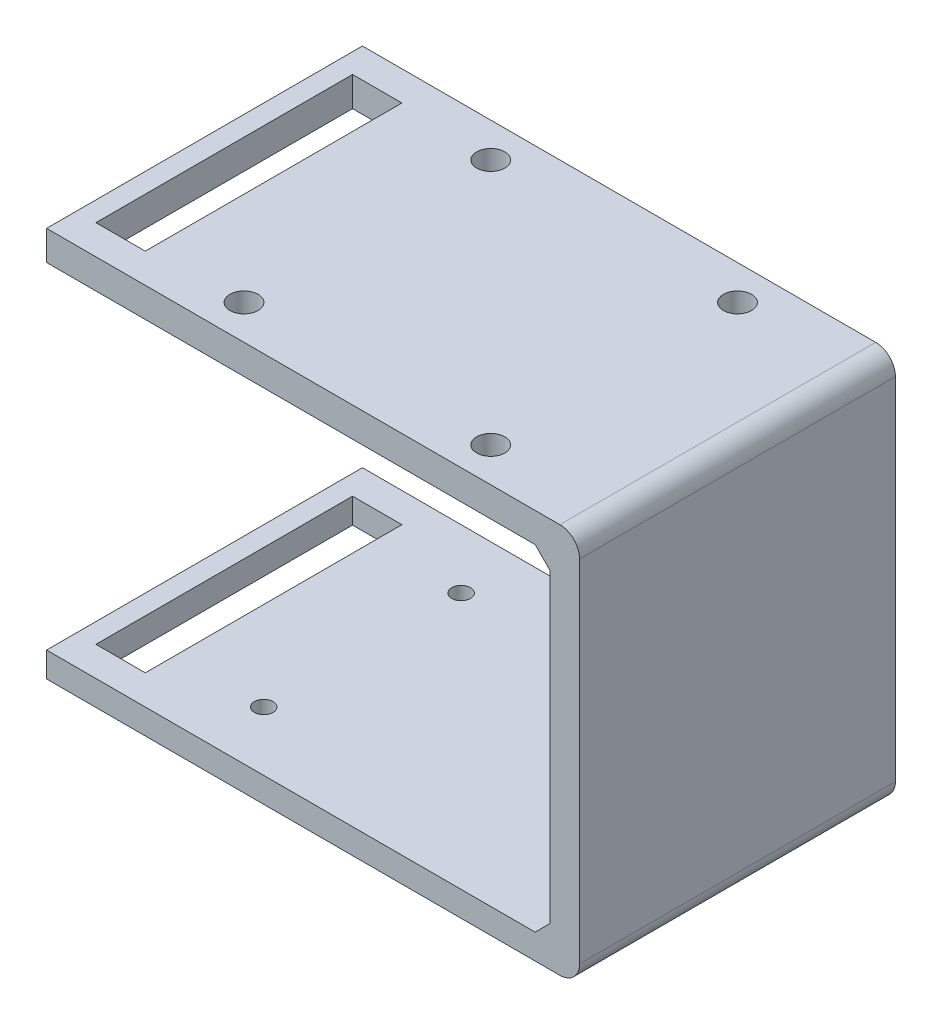
ISO-10303-21;
HEADER;
FILE_DESCRIPTION(('STEP AP214'),'2;1');
FILE_NAME('part.step','',(''),(''),'','','');
FILE_SCHEMA(('AUTOMOTIVE_DESIGN { 1 0 10303 214 1 1 1 1 }'));
ENDSEC;
DATA;
#1=APPLICATION_CONTEXT('core data for automotive mechanical design processes');
#2=APPLICATION_PROTOCOL_DEFINITION('international standard','automotive_design',2000,#1);
#3=PRODUCT_CONTEXT('',#1,'mechanical');
#4=PRODUCT('Part','Part','',(#3));
#5=PRODUCT_RELATED_PRODUCT_CATEGORY('part','',(#4));
#6=PRODUCT_DEFINITION_FORMATION('','',#4);
#7=PRODUCT_DEFINITION_CONTEXT('part definition',#1,'design');
#8=PRODUCT_DEFINITION('design','',#6,#7);
#9=PRODUCT_DEFINITION_SHAPE('','',#8);
#10=(LENGTH_UNIT() NAMED_UNIT(*) SI_UNIT(.MILLI.,.METRE.));
#11=(NAMED_UNIT(*) PLANE_ANGLE_UNIT() SI_UNIT($,.RADIAN.));
#12=(NAMED_UNIT(*) SI_UNIT($,.STERADIAN.) SOLID_ANGLE_UNIT());
#13=UNCERTAINTY_MEASURE_WITH_UNIT(LENGTH_MEASURE(1.E-05),#10,'distance_accuracy_value','');
#14=(GEOMETRIC_REPRESENTATION_CONTEXT(3) GLOBAL_UNCERTAINTY_ASSIGNED_CONTEXT((#13)) GLOBAL_UNIT_ASSIGNED_CONTEXT((#10,
#11,#12)) REPRESENTATION_CONTEXT('',''));
#15=CARTESIAN_POINT('',(0.,0.,0.));
#16=DIRECTION('',(0.,0.,1.));
#17=DIRECTION('',(1.,0.,0.));
#18=AXIS2_PLACEMENT_3D('',#15,#16,#17);
#19=CARTESIAN_POINT('',(0.,39.54,0.));
#20=DIRECTION('',(0.,1.,0.));
#21=DIRECTION('',(0.,0.,1.));
#22=AXIS2_PLACEMENT_3D('',#19,#20,#21);
#23=PLANE('',#22);
#24=DIRECTION('',(0.,0.,1.));
#25=VECTOR('',#24,1.);
#26=CARTESIAN_POINT('',(-24.,39.54,0.));
#27=LINE('',#26,#25);
#28=CARTESIAN_POINT('',(-24.,39.54,-3.));
#29=VERTEX_POINT('',#28);
#30=CARTESIAN_POINT('',(-24.,39.54,23.));
#31=VERTEX_POINT('',#30);
#32=EDGE_CURVE('E272',#29,#31,#27,.T.);
#33=ORIENTED_EDGE('',*,*,#32,.F.);
#34=DIRECTION('',(-1.,0.,0.));
#35=VECTOR('',#34,1.);
#36=CARTESIAN_POINT('',(0.,39.54,-3.));
#37=LINE('',#36,#35);
#38=CARTESIAN_POINT('',(-19.,39.54,-3.));
#39=VERTEX_POINT('',#38);
#40=EDGE_CURVE('E263',#39,#29,#37,.T.);
#41=ORIENTED_EDGE('',*,*,#40,.F.);
#42=DIRECTION('',(0.,0.,-1.));
#43=VECTOR('',#42,1.);
#44=CARTESIAN_POINT('',(-19.,39.54,0.));
#45=LINE('',#44,#43);
#46=CARTESIAN_POINT('',(-19.,39.54,23.));
#47=VERTEX_POINT('',#46);
#48=EDGE_CURVE('E253',#47,#39,#45,.T.);
#49=ORIENTED_EDGE('',*,*,#48,.F.);
#50=DIRECTION('',(1.,0.,0.));
#51=VECTOR('',#50,1.);
#52=CARTESIAN_POINT('',(0.,39.54,23.));
#53=LINE('',#52,#51);
#54=EDGE_CURVE('E243',#31,#47,#53,.T.);
#55=ORIENTED_EDGE('',*,*,#54,.F.);
#56=EDGE_LOOP('',(#33,#41,#49,#55));
#57=FACE_BOUND('',#56,.T.);
#58=CARTESIAN_POINT('',(15.5,39.54,-2.50000000000001));
#59=DIRECTION('',(0.,1.,0.));
#60=DIRECTION('',(0.,0.,1.));
#61=AXIS2_PLACEMENT_3D('',#58,#59,#60);
#62=CIRCLE('',#61,1.425);
#63=CARTESIAN_POINT('',(15.5,39.54,-1.07500000000001));
#64=VERTEX_POINT('',#63);
#65=EDGE_CURVE('E293',#64,#64,#62,.F.);
#66=ORIENTED_EDGE('',*,*,#65,.T.);
#67=EDGE_LOOP('',(#66));
#68=FACE_BOUND('',#67,.T.);
#69=CARTESIAN_POINT('',(-9.50000000000004,39.54,-2.50000000000001));
#70=DIRECTION('',(0.,1.,0.));
#71=DIRECTION('',(0.,0.,1.));
#72=AXIS2_PLACEMENT_3D('',#69,#70,#71);
#73=CIRCLE('',#72,1.425);
#74=CARTESIAN_POINT('',(-9.50000000000004,39.54,-1.07500000000001));
#75=VERTEX_POINT('',#74);
#76=EDGE_CURVE('E297',#75,#75,#73,.T.);
#77=ORIENTED_EDGE('',*,*,#76,.F.);
#78=EDGE_LOOP('',(#77));
#79=FACE_BOUND('',#78,.T.);
#80=DIRECTION('',(1.,0.,0.));
#81=VECTOR('',#80,1.);
#82=CARTESIAN_POINT('',(25.,39.54,26.));
#83=LINE('',#82,#81);
#84=CARTESIAN_POINT('',(-26.,39.54,26.));
#85=VERTEX_POINT('',#84);
#86=CARTESIAN_POINT('',(26.,39.54,26.));
#87=VERTEX_POINT('',#86);
#88=EDGE_CURVE('E318',#85,#87,#83,.T.);
#89=ORIENTED_EDGE('',*,*,#88,.T.);
#90=DIRECTION('',(0.,0.,-1.));
#91=VECTOR('',#90,1.);
#92=CARTESIAN_POINT('',(26.,39.54,0.));
#93=LINE('',#92,#91);
#94=CARTESIAN_POINT('',(26.,39.54,-6.));
#95=VERTEX_POINT('',#94);
#96=EDGE_CURVE('E414',#87,#95,#93,.T.);
#97=ORIENTED_EDGE('',*,*,#96,.T.);
#98=DIRECTION('',(-1.,0.,0.));
#99=VECTOR('',#98,1.);
#100=CARTESIAN_POINT('',(25.,39.54,-6.));
#101=LINE('',#100,#99);
#102=CARTESIAN_POINT('',(-26.,39.54,-6.));
#103=VERTEX_POINT('',#102);
#104=EDGE_CURVE('E322',#95,#103,#101,.T.);
#105=ORIENTED_EDGE('',*,*,#104,.T.);
#106=DIRECTION('',(0.,0.,-1.));
#107=VECTOR('',#106,1.);
#108=CARTESIAN_POINT('',(-26.,39.54,-6.));
#109=LINE('',#108,#107);
#110=EDGE_CURVE('E288',#85,#103,#109,.T.);
#111=ORIENTED_EDGE('',*,*,#110,.F.);
#112=EDGE_LOOP('',(#89,#97,#105,#111));
#113=FACE_BOUND('',#112,.T.);
#114=CARTESIAN_POINT('',(15.5,39.54,22.5));
#115=DIRECTION('',(0.,1.,0.));
#116=DIRECTION('',(0.,0.,1.));
#117=AXIS2_PLACEMENT_3D('',#114,#115,#116);
#118=CIRCLE('',#117,1.425);
#119=CARTESIAN_POINT('',(15.5,39.54,23.925));
#120=VERTEX_POINT('',#119);
#121=EDGE_CURVE('E298',#120,#120,#118,.T.);
#122=ORIENTED_EDGE('',*,*,#121,.F.);
#123=EDGE_LOOP('',(#122));
#124=FACE_BOUND('',#123,.T.);
#125=CARTESIAN_POINT('',(-9.50000000000004,39.54,22.5));
#126=DIRECTION('',(0.,1.,0.));
#127=DIRECTION('',(0.,0.,1.));
#128=AXIS2_PLACEMENT_3D('',#125,#126,#127);
#129=CIRCLE('',#128,1.425);
#130=CARTESIAN_POINT('',(-9.50000000000004,39.54,23.925));
#131=VERTEX_POINT('',#130);
#132=EDGE_CURVE('E292',#131,#131,#129,.F.);
#133=ORIENTED_EDGE('',*,*,#132,.T.);
#134=EDGE_LOOP('',(#133));
#135=FACE_BOUND('',#134,.T.);
#136=ADVANCED_FACE('F51',(#57,#68,#79,#113,#124,#135),#23,.T.);
#137=CARTESIAN_POINT('',(-22.,36.54,-6.));
#138=DIRECTION('',(0.,1.,0.));
#139=DIRECTION('',(0.,0.,1.));
#140=AXIS2_PLACEMENT_3D('',#137,#138,#139);
#141=PLANE('',#140);
#142=DIRECTION('',(-1.,0.,0.));
#143=VECTOR('',#142,1.);
#144=CARTESIAN_POINT('',(-22.,36.54,-3.));
#145=LINE('',#144,#143);
#146=CARTESIAN_POINT('',(-19.,36.54,-3.));
#147=VERTEX_POINT('',#146);
#148=CARTESIAN_POINT('',(-24.,36.54,-3.));
#149=VERTEX_POINT('',#148);
#150=EDGE_CURVE('E259',#147,#149,#145,.T.);
#151=ORIENTED_EDGE('',*,*,#150,.T.);
#152=DIRECTION('',(0.,0.,1.));
#153=VECTOR('',#152,1.);
#154=CARTESIAN_POINT('',(-24.,36.54,-6.));
#155=LINE('',#154,#153);
#156=CARTESIAN_POINT('',(-24.,36.54,23.));
#157=VERTEX_POINT('',#156);
#158=EDGE_CURVE('E268',#149,#157,#155,.T.);
#159=ORIENTED_EDGE('',*,*,#158,.T.);
#160=DIRECTION('',(1.,0.,0.));
#161=VECTOR('',#160,1.);
#162=CARTESIAN_POINT('',(-22.,36.54,23.));
#163=LINE('',#162,#161);
#164=CARTESIAN_POINT('',(-19.,36.54,23.));
#165=VERTEX_POINT('',#164);
#166=EDGE_CURVE('E239',#157,#165,#163,.T.);
#167=ORIENTED_EDGE('',*,*,#166,.T.);
#168=DIRECTION('',(0.,0.,-1.));
#169=VECTOR('',#168,1.);
#170=CARTESIAN_POINT('',(-19.,36.54,-6.));
#171=LINE('',#170,#169);
#172=EDGE_CURVE('E249',#165,#147,#171,.T.);
#173=ORIENTED_EDGE('',*,*,#172,.T.);
#174=EDGE_LOOP('',(#151,#159,#167,#173));
#175=FACE_BOUND('',#174,.T.);
#176=CARTESIAN_POINT('',(15.5,36.54,22.5));
#177=DIRECTION('',(0.,1.,0.));
#178=DIRECTION('',(0.,0.,1.));
#179=AXIS2_PLACEMENT_3D('',#176,#177,#178);
#180=CIRCLE('',#179,1.425);
#181=CARTESIAN_POINT('',(15.5,36.54,23.925));
#182=VERTEX_POINT('',#181);
#183=EDGE_CURVE('E426',#182,#182,#180,.T.);
#184=ORIENTED_EDGE('',*,*,#183,.T.);
#185=EDGE_LOOP('',(#184));
#186=FACE_BOUND('',#185,.T.);
#187=CARTESIAN_POINT('',(-9.50000000000004,36.54,-2.50000000000001));
#188=DIRECTION('',(0.,1.,0.));
#189=DIRECTION('',(0.,0.,1.));
#190=AXIS2_PLACEMENT_3D('',#187,#188,#189);
#191=CIRCLE('',#190,1.425);
#192=CARTESIAN_POINT('',(-9.50000000000004,36.54,-1.07500000000001));
#193=VERTEX_POINT('',#192);
#194=EDGE_CURVE('E308',#193,#193,#191,.T.);
#195=ORIENTED_EDGE('',*,*,#194,.T.);
#196=EDGE_LOOP('',(#195));
#197=FACE_BOUND('',#196,.T.);
#198=DIRECTION('',(1.,0.,0.));
#199=VECTOR('',#198,1.);
#200=CARTESIAN_POINT('',(-22.,36.54,-6.));
#201=LINE('',#200,#199);
#202=CARTESIAN_POINT('',(-26.,36.54,-6.));
#203=VERTEX_POINT('',#202);
#204=CARTESIAN_POINT('',(23.5,36.54,-6.));
#205=VERTEX_POINT('',#204);
#206=EDGE_CURVE('E313',#203,#205,#201,.T.);
#207=ORIENTED_EDGE('',*,*,#206,.T.);
#208=DIRECTION('',(0.,0.,1.));
#209=VECTOR('',#208,1.);
#210=CARTESIAN_POINT('',(23.5,36.54,26.));
#211=LINE('',#210,#209);
#212=CARTESIAN_POINT('',(23.5,36.54,26.));
#213=VERTEX_POINT('',#212);
#214=EDGE_CURVE('E418',#205,#213,#211,.T.);
#215=ORIENTED_EDGE('',*,*,#214,.T.);
#216=DIRECTION('',(1.,0.,0.));
#217=VECTOR('',#216,1.);
#218=CARTESIAN_POINT('',(-22.,36.54,26.));
#219=LINE('',#218,#217);
#220=CARTESIAN_POINT('',(-26.,36.54,26.));
#221=VERTEX_POINT('',#220);
#222=EDGE_CURVE('E309',#221,#213,#219,.T.);
#223=ORIENTED_EDGE('',*,*,#222,.F.);
#224=DIRECTION('',(0.,0.,1.));
#225=VECTOR('',#224,1.);
#226=CARTESIAN_POINT('',(-26.,36.54,-6.));
#227=LINE('',#226,#225);
#228=EDGE_CURVE('E280',#203,#221,#227,.T.);
#229=ORIENTED_EDGE('',*,*,#228,.F.);
#230=EDGE_LOOP('',(#207,#215,#223,#229));
#231=FACE_BOUND('',#230,.T.);
#232=CARTESIAN_POINT('',(15.5,36.54,-2.50000000000001));
#233=DIRECTION('',(0.,1.,0.));
#234=DIRECTION('',(0.,0.,1.));
#235=AXIS2_PLACEMENT_3D('',#232,#233,#234);
#236=CIRCLE('',#235,1.425);
#237=CARTESIAN_POINT('',(15.5,36.54,-1.07500000000001));
#238=VERTEX_POINT('',#237);
#239=EDGE_CURVE('E422',#238,#238,#236,.F.);
#240=ORIENTED_EDGE('',*,*,#239,.F.);
#241=EDGE_LOOP('',(#240));
#242=FACE_BOUND('',#241,.T.);
#243=CARTESIAN_POINT('',(-9.50000000000004,36.54,22.5));
#244=DIRECTION('',(0.,1.,0.));
#245=DIRECTION('',(0.,0.,1.));
#246=AXIS2_PLACEMENT_3D('',#243,#244,#245);
#247=CIRCLE('',#246,1.425);
#248=CARTESIAN_POINT('',(-9.50000000000004,36.54,23.925));
#249=VERTEX_POINT('',#248);
#250=EDGE_CURVE('E314',#249,#249,#247,.F.);
#251=ORIENTED_EDGE('',*,*,#250,.F.);
#252=EDGE_LOOP('',(#251));
#253=FACE_BOUND('',#252,.T.);
#254=ADVANCED_FACE('F477',(#175,#186,#197,#231,#242,#253),#141,.F.);
#255=CARTESIAN_POINT('',(25.,39.54,-6.));
#256=DIRECTION('',(1.,0.,0.));
#257=DIRECTION('',(0.,0.,-1.));
#258=AXIS2_PLACEMENT_3D('',#255,#256,#257);
#259=PLANE('',#258);
#260=DIRECTION('',(0.,-1.,0.));
#261=VECTOR('',#260,1.);
#262=CARTESIAN_POINT('',(25.,39.54,26.));
#263=LINE('',#262,#261);
#264=CARTESIAN_POINT('',(25.,35.04,26.));
#265=VERTEX_POINT('',#264);
#266=CARTESIAN_POINT('',(25.,4.04000000000002,26.));
#267=VERTEX_POINT('',#266);
#268=EDGE_CURVE('E329',#265,#267,#263,.T.);
#269=ORIENTED_EDGE('',*,*,#268,.F.);
#270=DIRECTION('',(0.,0.,-1.));
#271=VECTOR('',#270,1.);
#272=CARTESIAN_POINT('',(25.,35.04,-6.));
#273=LINE('',#272,#271);
#274=CARTESIAN_POINT('',(25.,35.04,-6.));
#275=VERTEX_POINT('',#274);
#276=EDGE_CURVE('E440',#265,#275,#273,.T.);
#277=ORIENTED_EDGE('',*,*,#276,.T.);
#278=DIRECTION('',(0.,-1.,0.));
#279=VECTOR('',#278,1.);
#280=CARTESIAN_POINT('',(25.,39.54,-6.));
#281=LINE('',#280,#279);
#282=CARTESIAN_POINT('',(25.,4.04000000000002,-6.));
#283=VERTEX_POINT('',#282);
#284=EDGE_CURVE('E325',#275,#283,#281,.T.);
#285=ORIENTED_EDGE('',*,*,#284,.T.);
#286=DIRECTION('',(0.,0.,1.));
#287=VECTOR('',#286,1.);
#288=CARTESIAN_POINT('',(25.,4.04000000000002,-6.));
#289=LINE('',#288,#287);
#290=EDGE_CURVE('E436',#283,#267,#289,.T.);
#291=ORIENTED_EDGE('',*,*,#290,.T.);
#292=EDGE_LOOP('',(#269,#277,#285,#291));
#293=FACE_BOUND('',#292,.T.);
#294=ADVANCED_FACE('F480',(#293),#259,.F.);
#295=CARTESIAN_POINT('',(0.,2.54,26.));
#296=DIRECTION('',(0.,0.,1.));
#297=DIRECTION('',(1.,0.,0.));
#298=AXIS2_PLACEMENT_3D('',#295,#296,#297);
#299=PLANE('',#298);
#300=DIRECTION('',(-1.,0.,0.));
#301=VECTOR('',#300,1.);
#302=CARTESIAN_POINT('',(0.,0.,26.));
#303=LINE('',#302,#301);
#304=CARTESIAN_POINT('',(26.,0.,26.));
#305=VERTEX_POINT('',#304);
#306=CARTESIAN_POINT('',(-26.,0.,26.));
#307=VERTEX_POINT('',#306);
#308=EDGE_CURVE('E368',#305,#307,#303,.T.);
#309=ORIENTED_EDGE('',*,*,#308,.F.);
#310=CARTESIAN_POINT('',(26.,2.,26.));
#311=DIRECTION('',(0.,0.,1.));
#312=DIRECTION('',(1.,0.,0.));
#313=AXIS2_PLACEMENT_3D('',#310,#311,#312);
#314=CIRCLE('',#313,2.);
#315=CARTESIAN_POINT('',(28.,2.,26.));
#316=VERTEX_POINT('',#315);
#317=EDGE_CURVE('E399',#305,#316,#314,.T.);
#318=ORIENTED_EDGE('',*,*,#317,.T.);
#319=DIRECTION('',(0.,-1.,0.));
#320=VECTOR('',#319,1.);
#321=CARTESIAN_POINT('',(28.,2.54,26.));
#322=LINE('',#321,#320);
#323=CARTESIAN_POINT('',(28.,37.54,26.));
#324=VERTEX_POINT('',#323);
#325=EDGE_CURVE('E388',#324,#316,#322,.T.);
#326=ORIENTED_EDGE('',*,*,#325,.F.);
#327=CARTESIAN_POINT('',(26.,37.54,26.));
#328=DIRECTION('',(0.,0.,1.));
#329=DIRECTION('',(1.,0.,0.));
#330=AXIS2_PLACEMENT_3D('',#327,#328,#329);
#331=CIRCLE('',#330,2.);
#332=EDGE_CURVE('E396',#324,#87,#331,.T.);
#333=ORIENTED_EDGE('',*,*,#332,.T.);
#334=ORIENTED_EDGE('',*,*,#88,.F.);
#335=DIRECTION('',(0.,1.,0.));
#336=VECTOR('',#335,1.);
#337=CARTESIAN_POINT('',(-26.,39.54,26.));
#338=LINE('',#337,#336);
#339=EDGE_CURVE('E284',#221,#85,#338,.T.);
#340=ORIENTED_EDGE('',*,*,#339,.F.);
#341=ORIENTED_EDGE('',*,*,#222,.T.);
#342=DIRECTION('',(-0.707106781186554,0.707106781186541,0.));
#343=VECTOR('',#342,1.);
#344=CARTESIAN_POINT('',(23.5,36.54,26.));
#345=LINE('',#344,#343);
#346=EDGE_CURVE('E445',#213,#265,#345,.F.);
#347=ORIENTED_EDGE('',*,*,#346,.T.);
#348=ORIENTED_EDGE('',*,*,#268,.T.);
#349=DIRECTION('',(-0.707106781186543,-0.707106781186553,0.));
#350=VECTOR('',#349,1.);
#351=CARTESIAN_POINT('',(25.,4.04000000000002,26.));
#352=LINE('',#351,#350);
#353=CARTESIAN_POINT('',(23.5,2.54,26.));
#354=VERTEX_POINT('',#353);
#355=EDGE_CURVE('E61',#267,#354,#352,.T.);
#356=ORIENTED_EDGE('',*,*,#355,.T.);
#357=DIRECTION('',(-1.,0.,0.));
#358=VECTOR('',#357,1.);
#359=CARTESIAN_POINT('',(0.,2.54,26.));
#360=LINE('',#359,#358);
#361=CARTESIAN_POINT('',(-26.,2.54,26.));
#362=VERTEX_POINT('',#361);
#363=EDGE_CURVE('E346',#354,#362,#360,.T.);
#364=ORIENTED_EDGE('',*,*,#363,.T.);
#365=DIRECTION('',(0.,-1.,0.));
#366=VECTOR('',#365,1.);
#367=CARTESIAN_POINT('',(-26.,2.54,26.));
#368=LINE('',#367,#366);
#369=EDGE_CURVE('E356',#362,#307,#368,.T.);
#370=ORIENTED_EDGE('',*,*,#369,.T.);
#371=EDGE_LOOP('',(#309,#318,#326,#333,#334,#340,#341,#347,#348,#356,#364,#370));
#372=FACE_BOUND('',#371,.T.);
#373=ADVANCED_FACE('F518',(#372),#299,.T.);
#374=CARTESIAN_POINT('',(28.,2.54,0.));
#375=DIRECTION('',(1.,0.,0.));
#376=DIRECTION('',(0.,0.,-1.));
#377=AXIS2_PLACEMENT_3D('',#374,#375,#376);
#378=PLANE('',#377);
#379=ORIENTED_EDGE('',*,*,#325,.T.);
#380=DIRECTION('',(0.,0.,1.));
#381=VECTOR('',#380,1.);
#382=CARTESIAN_POINT('',(28.,2.,-6.));
#383=LINE('',#382,#381);
#384=CARTESIAN_POINT('',(28.,2.,-6.));
#385=VERTEX_POINT('',#384);
#386=EDGE_CURVE('E405',#316,#385,#383,.F.);
#387=ORIENTED_EDGE('',*,*,#386,.T.);
#388=DIRECTION('',(0.,-1.,0.));
#389=VECTOR('',#388,1.);
#390=CARTESIAN_POINT('',(28.,2.54,-6.));
#391=LINE('',#390,#389);
#392=CARTESIAN_POINT('',(28.,37.54,-6.));
#393=VERTEX_POINT('',#392);
#394=EDGE_CURVE('E384',#393,#385,#391,.T.);
#395=ORIENTED_EDGE('',*,*,#394,.F.);
#396=DIRECTION('',(0.,0.,-1.));
#397=VECTOR('',#396,1.);
#398=CARTESIAN_POINT('',(28.,37.54,0.));
#399=LINE('',#398,#397);
#400=EDGE_CURVE('E402',#393,#324,#399,.F.);
#401=ORIENTED_EDGE('',*,*,#400,.T.);
#402=EDGE_LOOP('',(#379,#387,#395,#401));
#403=FACE_BOUND('',#402,.T.);
#404=ADVANCED_FACE('F535',(#403),#378,.T.);
#405=CARTESIAN_POINT('',(0.,2.54,-5.99999999999998));
#406=DIRECTION('',(0.,0.,1.));
#407=DIRECTION('',(1.,0.,0.));
#408=AXIS2_PLACEMENT_3D('',#405,#406,#407);
#409=PLANE('',#408);
#410=ORIENTED_EDGE('',*,*,#394,.T.);
#411=CARTESIAN_POINT('',(26.,2.,-5.99999999999999));
#412=DIRECTION('',(0.,0.,1.));
#413=DIRECTION('',(1.,0.,0.));
#414=AXIS2_PLACEMENT_3D('',#411,#412,#413);
#415=CIRCLE('',#414,2.);
#416=CARTESIAN_POINT('',(26.,0.,-5.99999999999999));
#417=VERTEX_POINT('',#416);
#418=EDGE_CURVE('E411',#385,#417,#415,.F.);
#419=ORIENTED_EDGE('',*,*,#418,.T.);
#420=DIRECTION('',(-1.,0.,0.));
#421=VECTOR('',#420,1.);
#422=CARTESIAN_POINT('',(0.,0.,-5.99999999999998));
#423=LINE('',#422,#421);
#424=CARTESIAN_POINT('',(-26.,0.,-5.99999999999998));
#425=VERTEX_POINT('',#424);
#426=EDGE_CURVE('E371',#417,#425,#423,.T.);
#427=ORIENTED_EDGE('',*,*,#426,.T.);
#428=DIRECTION('',(0.,-1.,0.));
#429=VECTOR('',#428,1.);
#430=CARTESIAN_POINT('',(-26.,2.54,-5.99999999999998));
#431=LINE('',#430,#429);
#432=CARTESIAN_POINT('',(-26.,2.54,-5.99999999999998));
#433=VERTEX_POINT('',#432);
#434=EDGE_CURVE('E380',#433,#425,#431,.T.);
#435=ORIENTED_EDGE('',*,*,#434,.F.);
#436=DIRECTION('',(-1.,0.,0.));
#437=VECTOR('',#436,1.);
#438=CARTESIAN_POINT('',(0.,2.54,-5.99999999999998));
#439=LINE('',#438,#437);
#440=CARTESIAN_POINT('',(23.5,2.54,-5.99999999999999));
#441=VERTEX_POINT('',#440);
#442=EDGE_CURVE('E349',#441,#433,#439,.T.);
#443=ORIENTED_EDGE('',*,*,#442,.F.);
#444=DIRECTION('',(0.707106781186543,0.707106781186553,0.));
#445=VECTOR('',#444,1.);
#446=CARTESIAN_POINT('',(11.7500000000002,-9.20999999999998,-5.99999999999999));
#447=LINE('',#446,#445);
#448=EDGE_CURVE('E11',#441,#283,#447,.T.);
#449=ORIENTED_EDGE('',*,*,#448,.T.);
#450=ORIENTED_EDGE('',*,*,#284,.F.);
#451=DIRECTION('',(0.707106781186554,-0.707106781186541,0.));
#452=VECTOR('',#451,1.);
#453=CARTESIAN_POINT('',(28.7499999999998,31.2900000000003,-5.99999999999999));
#454=LINE('',#453,#452);
#455=EDGE_CURVE('E448',#275,#205,#454,.F.);
#456=ORIENTED_EDGE('',*,*,#455,.T.);
#457=ORIENTED_EDGE('',*,*,#206,.F.);
#458=DIRECTION('',(0.,-1.,0.));
#459=VECTOR('',#458,1.);
#460=CARTESIAN_POINT('',(-26.,39.54,-6.));
#461=LINE('',#460,#459);
#462=EDGE_CURVE('E276',#103,#203,#461,.T.);
#463=ORIENTED_EDGE('',*,*,#462,.F.);
#464=ORIENTED_EDGE('',*,*,#104,.F.);
#465=CARTESIAN_POINT('',(26.,37.54,-5.99999999999999));
#466=DIRECTION('',(0.,0.,1.));
#467=DIRECTION('',(1.,0.,0.));
#468=AXIS2_PLACEMENT_3D('',#465,#466,#467);
#469=CIRCLE('',#468,2.);
#470=EDGE_CURVE('E408',#95,#393,#469,.F.);
#471=ORIENTED_EDGE('',*,*,#470,.T.);
#472=EDGE_LOOP('',(#410,#419,#427,#435,#443,#449,#450,#456,#457,#463,#464,#471));
#473=FACE_BOUND('',#472,.T.);
#474=ADVANCED_FACE('F531',(#473),#409,.F.);
#475=CARTESIAN_POINT('',(20.,2.54,9.99999999999999));
#476=DIRECTION('',(0.,-1.,0.));
#477=DIRECTION('',(0.,0.,-1.));
#478=AXIS2_PLACEMENT_3D('',#475,#476,#477);
#479=CYLINDRICAL_SURFACE('',#478,0.950000000000001);
#480=CARTESIAN_POINT('',(20.,2.54,9.99999999999999));
#481=DIRECTION('',(0.,1.,0.));
#482=DIRECTION('',(0.,0.,1.));
#483=AXIS2_PLACEMENT_3D('',#480,#481,#482);
#484=CIRCLE('',#483,0.950000000000001);
#485=CARTESIAN_POINT('',(20.,2.54,10.95));
#486=VERTEX_POINT('',#485);
#487=EDGE_CURVE('E342',#486,#486,#484,.T.);
#488=ORIENTED_EDGE('',*,*,#487,.T.);
#489=EDGE_LOOP('',(#488));
#490=FACE_BOUND('',#489,.T.);
#491=CARTESIAN_POINT('',(20.,0.,9.99999999999999));
#492=DIRECTION('',(0.,1.,0.));
#493=DIRECTION('',(0.,0.,1.));
#494=AXIS2_PLACEMENT_3D('',#491,#492,#493);
#495=CIRCLE('',#494,0.950000000000001);
#496=CARTESIAN_POINT('',(20.,0.,10.95));
#497=VERTEX_POINT('',#496);
#498=EDGE_CURVE('E364',#497,#497,#495,.T.);
#499=ORIENTED_EDGE('',*,*,#498,.F.);
#500=EDGE_LOOP('',(#499));
#501=FACE_BOUND('',#500,.T.);
#502=ADVANCED_FACE('F534',(#490,#501),#479,.F.);
#503=CARTESIAN_POINT('',(-10.,2.54,0.));
#504=DIRECTION('',(0.,-1.,0.));
#505=DIRECTION('',(0.,0.,-1.));
#506=AXIS2_PLACEMENT_3D('',#503,#504,#505);
#507=CYLINDRICAL_SURFACE('',#506,0.949999999999999);
#508=CARTESIAN_POINT('',(-10.,2.54,0.));
#509=DIRECTION('',(0.,1.,0.));
#510=DIRECTION('',(0.,0.,1.));
#511=AXIS2_PLACEMENT_3D('',#508,#509,#510);
#512=CIRCLE('',#511,0.949999999999999);
#513=CARTESIAN_POINT('',(-10.,2.54,0.950000000000003));
#514=VERTEX_POINT('',#513);
#515=EDGE_CURVE('E337',#514,#514,#512,.T.);
#516=ORIENTED_EDGE('',*,*,#515,.T.);
#517=EDGE_LOOP('',(#516));
#518=FACE_BOUND('',#517,.T.);
#519=CARTESIAN_POINT('',(-10.,0.,0.));
#520=DIRECTION('',(0.,1.,0.));
#521=DIRECTION('',(0.,0.,1.));
#522=AXIS2_PLACEMENT_3D('',#519,#520,#521);
#523=CIRCLE('',#522,0.949999999999999);
#524=CARTESIAN_POINT('',(-10.,0.,0.950000000000003));
#525=VERTEX_POINT('',#524);
#526=EDGE_CURVE('E360',#525,#525,#523,.T.);
#527=ORIENTED_EDGE('',*,*,#526,.F.);
#528=EDGE_LOOP('',(#527));
#529=FACE_BOUND('',#528,.T.);
#530=ADVANCED_FACE('F544',(#518,#529),#507,.F.);
#531=CARTESIAN_POINT('',(-9.99999999999999,2.54,20.));
#532=DIRECTION('',(0.,-1.,0.));
#533=DIRECTION('',(0.,0.,-1.));
#534=AXIS2_PLACEMENT_3D('',#531,#532,#533);
#535=CYLINDRICAL_SURFACE('',#534,0.949999999999999);
#536=CARTESIAN_POINT('',(-9.99999999999999,2.54,20.));
#537=DIRECTION('',(0.,1.,0.));
#538=DIRECTION('',(0.,0.,1.));
#539=AXIS2_PLACEMENT_3D('',#536,#537,#538);
#540=CIRCLE('',#539,0.949999999999999);
#541=CARTESIAN_POINT('',(-9.99999999999999,2.54,20.95));
#542=VERTEX_POINT('',#541);
#543=EDGE_CURVE('E333',#542,#542,#540,.F.);
#544=ORIENTED_EDGE('',*,*,#543,.F.);
#545=EDGE_LOOP('',(#544));
#546=FACE_BOUND('',#545,.T.);
#547=CARTESIAN_POINT('',(-9.99999999999999,0.,20.));
#548=DIRECTION('',(0.,1.,0.));
#549=DIRECTION('',(0.,0.,1.));
#550=AXIS2_PLACEMENT_3D('',#547,#548,#549);
#551=CIRCLE('',#550,0.949999999999999);
#552=CARTESIAN_POINT('',(-9.99999999999999,0.,20.95));
#553=VERTEX_POINT('',#552);
#554=EDGE_CURVE('E332',#553,#553,#551,.F.);
#555=ORIENTED_EDGE('',*,*,#554,.T.);
#556=EDGE_LOOP('',(#555));
#557=FACE_BOUND('',#556,.T.);
#558=ADVANCED_FACE('F529',(#546,#557),#535,.F.);
#559=CARTESIAN_POINT('',(-26.,2.54,0.));
#560=DIRECTION('',(1.,0.,0.));
#561=DIRECTION('',(0.,0.,-1.));
#562=AXIS2_PLACEMENT_3D('',#559,#560,#561);
#563=PLANE('',#562);
#564=DIRECTION('',(0.,0.,1.));
#565=VECTOR('',#564,1.);
#566=CARTESIAN_POINT('',(-26.,0.,0.));
#567=LINE('',#566,#565);
#568=EDGE_CURVE('E338',#425,#307,#567,.T.);
#569=ORIENTED_EDGE('',*,*,#568,.T.);
#570=ORIENTED_EDGE('',*,*,#369,.F.);
#571=DIRECTION('',(0.,0.,1.));
#572=VECTOR('',#571,1.);
#573=CARTESIAN_POINT('',(-26.,2.54,0.));
#574=LINE('',#573,#572);
#575=EDGE_CURVE('E352',#433,#362,#574,.T.);
#576=ORIENTED_EDGE('',*,*,#575,.F.);
#577=ORIENTED_EDGE('',*,*,#434,.T.);
#578=EDGE_LOOP('',(#569,#570,#576,#577));
#579=FACE_BOUND('',#578,.T.);
#580=ADVANCED_FACE('F523',(#579),#563,.F.);
#581=CARTESIAN_POINT('',(0.,2.54,0.));
#582=DIRECTION('',(0.,1.,0.));
#583=DIRECTION('',(0.,0.,1.));
#584=AXIS2_PLACEMENT_3D('',#581,#582,#583);
#585=PLANE('',#584);
#586=DIRECTION('',(0.,0.,1.));
#587=VECTOR('',#586,1.);
#588=CARTESIAN_POINT('',(-24.,2.54,0.));
#589=LINE('',#588,#587);
#590=CARTESIAN_POINT('',(-24.,2.54,-3.));
#591=VERTEX_POINT('',#590);
#592=CARTESIAN_POINT('',(-24.,2.54,23.));
#593=VERTEX_POINT('',#592);
#594=EDGE_CURVE('E196',#591,#593,#589,.T.);
#595=ORIENTED_EDGE('',*,*,#594,.F.);
#596=DIRECTION('',(-1.,0.,0.));
#597=VECTOR('',#596,1.);
#598=CARTESIAN_POINT('',(0.,2.54,-3.));
#599=LINE('',#598,#597);
#600=CARTESIAN_POINT('',(-19.,2.54,-3.));
#601=VERTEX_POINT('',#600);
#602=EDGE_CURVE('E256',#601,#591,#599,.T.);
#603=ORIENTED_EDGE('',*,*,#602,.F.);
#604=DIRECTION('',(0.,0.,-1.));
#605=VECTOR('',#604,1.);
#606=CARTESIAN_POINT('',(-19.,2.54,0.));
#607=LINE('',#606,#605);
#608=CARTESIAN_POINT('',(-19.,2.54,23.));
#609=VERTEX_POINT('',#608);
#610=EDGE_CURVE('E246',#609,#601,#607,.T.);
#611=ORIENTED_EDGE('',*,*,#610,.F.);
#612=DIRECTION('',(1.,0.,0.));
#613=VECTOR('',#612,1.);
#614=CARTESIAN_POINT('',(0.,2.54,23.));
#615=LINE('',#614,#613);
#616=EDGE_CURVE('E228',#593,#609,#615,.T.);
#617=ORIENTED_EDGE('',*,*,#616,.F.);
#618=EDGE_LOOP('',(#595,#603,#611,#617));
#619=FACE_BOUND('',#618,.T.);
#620=ORIENTED_EDGE('',*,*,#363,.F.);
#621=DIRECTION('',(0.,0.,-1.));
#622=VECTOR('',#621,1.);
#623=CARTESIAN_POINT('',(23.5,2.54,0.));
#624=LINE('',#623,#622);
#625=EDGE_CURVE('E74',#354,#441,#624,.T.);
#626=ORIENTED_EDGE('',*,*,#625,.T.);
#627=ORIENTED_EDGE('',*,*,#442,.T.);
#628=ORIENTED_EDGE('',*,*,#575,.T.);
#629=EDGE_LOOP('',(#620,#626,#627,#628));
#630=FACE_BOUND('',#629,.T.);
#631=ORIENTED_EDGE('',*,*,#543,.T.);
#632=EDGE_LOOP('',(#631));
#633=FACE_BOUND('',#632,.T.);
#634=ORIENTED_EDGE('',*,*,#515,.F.);
#635=EDGE_LOOP('',(#634));
#636=FACE_BOUND('',#635,.T.);
#637=ORIENTED_EDGE('',*,*,#487,.F.);
#638=EDGE_LOOP('',(#637));
#639=FACE_BOUND('',#638,.T.);
#640=ADVANCED_FACE('F520',(#619,#630,#633,#636,#639),#585,.T.);
#641=CARTESIAN_POINT('',(0.,0.,0.));
#642=DIRECTION('',(0.,1.,0.));
#643=DIRECTION('',(0.,0.,1.));
#644=AXIS2_PLACEMENT_3D('',#641,#642,#643);
#645=PLANE('',#644);
#646=DIRECTION('',(-1.,0.,0.));
#647=VECTOR('',#646,1.);
#648=CARTESIAN_POINT('',(-24.,0.,-3.));
#649=LINE('',#648,#647);
#650=CARTESIAN_POINT('',(-19.,0.,-3.));
#651=VERTEX_POINT('',#650);
#652=CARTESIAN_POINT('',(-24.,0.,-3.));
#653=VERTEX_POINT('',#652);
#654=EDGE_CURVE('E217',#651,#653,#649,.T.);
#655=ORIENTED_EDGE('',*,*,#654,.T.);
#656=DIRECTION('',(0.,0.,1.));
#657=VECTOR('',#656,1.);
#658=CARTESIAN_POINT('',(-24.,0.,-3.));
#659=LINE('',#658,#657);
#660=CARTESIAN_POINT('',(-24.,0.,23.));
#661=VERTEX_POINT('',#660);
#662=EDGE_CURVE('E193',#653,#661,#659,.T.);
#663=ORIENTED_EDGE('',*,*,#662,.T.);
#664=DIRECTION('',(1.,0.,0.));
#665=VECTOR('',#664,1.);
#666=CARTESIAN_POINT('',(-24.,0.,23.));
#667=LINE('',#666,#665);
#668=CARTESIAN_POINT('',(-19.,0.,23.));
#669=VERTEX_POINT('',#668);
#670=EDGE_CURVE('E205',#661,#669,#667,.T.);
#671=ORIENTED_EDGE('',*,*,#670,.T.);
#672=DIRECTION('',(0.,0.,-1.));
#673=VECTOR('',#672,1.);
#674=CARTESIAN_POINT('',(-19.,0.,-3.));
#675=LINE('',#674,#673);
#676=EDGE_CURVE('E212',#669,#651,#675,.T.);
#677=ORIENTED_EDGE('',*,*,#676,.T.);
#678=EDGE_LOOP('',(#655,#663,#671,#677));
#679=FACE_BOUND('',#678,.T.);
#680=ORIENTED_EDGE('',*,*,#554,.F.);
#681=EDGE_LOOP('',(#680));
#682=FACE_BOUND('',#681,.T.);
#683=ORIENTED_EDGE('',*,*,#526,.T.);
#684=EDGE_LOOP('',(#683));
#685=FACE_BOUND('',#684,.T.);
#686=ORIENTED_EDGE('',*,*,#498,.T.);
#687=EDGE_LOOP('',(#686));
#688=FACE_BOUND('',#687,.T.);
#689=ORIENTED_EDGE('',*,*,#426,.F.);
#690=DIRECTION('',(0.,0.,1.));
#691=VECTOR('',#690,1.);
#692=CARTESIAN_POINT('',(26.,0.,26.));
#693=LINE('',#692,#691);
#694=EDGE_CURVE('E392',#417,#305,#693,.T.);
#695=ORIENTED_EDGE('',*,*,#694,.T.);
#696=ORIENTED_EDGE('',*,*,#308,.T.);
#697=ORIENTED_EDGE('',*,*,#568,.F.);
#698=EDGE_LOOP('',(#689,#695,#696,#697));
#699=FACE_BOUND('',#698,.T.);
#700=ADVANCED_FACE('F214',(#679,#682,#685,#688,#699),#645,.F.);
#701=CARTESIAN_POINT('',(26.,2.,0.));
#702=DIRECTION('',(0.,0.,-1.));
#703=DIRECTION('',(-1.,0.,0.));
#704=AXIS2_PLACEMENT_3D('',#701,#702,#703);
#705=CYLINDRICAL_SURFACE('',#704,2.);
#706=ORIENTED_EDGE('',*,*,#418,.F.);
#707=ORIENTED_EDGE('',*,*,#386,.F.);
#708=ORIENTED_EDGE('',*,*,#317,.F.);
#709=ORIENTED_EDGE('',*,*,#694,.F.);
#710=EDGE_LOOP('',(#706,#707,#708,#709));
#711=FACE_BOUND('',#710,.T.);
#712=ADVANCED_FACE('F526',(#711),#705,.T.);
#713=CARTESIAN_POINT('',(26.,37.54,0.));
#714=DIRECTION('',(0.,0.,-1.));
#715=DIRECTION('',(-1.,0.,0.));
#716=AXIS2_PLACEMENT_3D('',#713,#714,#715);
#717=CYLINDRICAL_SURFACE('',#716,2.);
#718=ORIENTED_EDGE('',*,*,#332,.F.);
#719=ORIENTED_EDGE('',*,*,#400,.F.);
#720=ORIENTED_EDGE('',*,*,#470,.F.);
#721=ORIENTED_EDGE('',*,*,#96,.F.);
#722=EDGE_LOOP('',(#718,#719,#720,#721));
#723=FACE_BOUND('',#722,.T.);
#724=ADVANCED_FACE('F554',(#723),#717,.T.);
#725=CARTESIAN_POINT('',(-9.50000000000004,19.54,-2.50000000000001));
#726=DIRECTION('',(0.,1.,0.));
#727=DIRECTION('',(0.,0.,1.));
#728=AXIS2_PLACEMENT_3D('',#725,#726,#727);
#729=CYLINDRICAL_SURFACE('',#728,1.425);
#730=ORIENTED_EDGE('',*,*,#76,.T.);
#731=EDGE_LOOP('',(#730));
#732=FACE_BOUND('',#731,.T.);
#733=ORIENTED_EDGE('',*,*,#194,.F.);
#734=EDGE_LOOP('',(#733));
#735=FACE_BOUND('',#734,.T.);
#736=ADVANCED_FACE('F557',(#732,#735),#729,.F.);
#737=CARTESIAN_POINT('',(15.5,19.54,-2.50000000000001));
#738=DIRECTION('',(0.,1.,0.));
#739=DIRECTION('',(0.,0.,1.));
#740=AXIS2_PLACEMENT_3D('',#737,#738,#739);
#741=CYLINDRICAL_SURFACE('',#740,1.425);
#742=ORIENTED_EDGE('',*,*,#65,.F.);
#743=EDGE_LOOP('',(#742));
#744=FACE_BOUND('',#743,.T.);
#745=ORIENTED_EDGE('',*,*,#239,.T.);
#746=EDGE_LOOP('',(#745));
#747=FACE_BOUND('',#746,.T.);
#748=ADVANCED_FACE('F505',(#744,#747),#741,.F.);
#749=CARTESIAN_POINT('',(15.5,19.54,22.5));
#750=DIRECTION('',(0.,1.,0.));
#751=DIRECTION('',(0.,0.,1.));
#752=AXIS2_PLACEMENT_3D('',#749,#750,#751);
#753=CYLINDRICAL_SURFACE('',#752,1.425);
#754=ORIENTED_EDGE('',*,*,#121,.T.);
#755=EDGE_LOOP('',(#754));
#756=FACE_BOUND('',#755,.T.);
#757=ORIENTED_EDGE('',*,*,#183,.F.);
#758=EDGE_LOOP('',(#757));
#759=FACE_BOUND('',#758,.T.);
#760=ADVANCED_FACE('F496',(#756,#759),#753,.F.);
#761=CARTESIAN_POINT('',(-9.50000000000004,19.54,22.5));
#762=DIRECTION('',(0.,1.,0.));
#763=DIRECTION('',(0.,0.,1.));
#764=AXIS2_PLACEMENT_3D('',#761,#762,#763);
#765=CYLINDRICAL_SURFACE('',#764,1.425);
#766=ORIENTED_EDGE('',*,*,#132,.F.);
#767=EDGE_LOOP('',(#766));
#768=FACE_BOUND('',#767,.T.);
#769=ORIENTED_EDGE('',*,*,#250,.T.);
#770=EDGE_LOOP('',(#769));
#771=FACE_BOUND('',#770,.T.);
#772=ADVANCED_FACE('F493',(#768,#771),#765,.F.);
#773=CARTESIAN_POINT('',(-26.,0.,0.));
#774=DIRECTION('',(-1.,0.,0.));
#775=DIRECTION('',(0.,0.,1.));
#776=AXIS2_PLACEMENT_3D('',#773,#774,#775);
#777=PLANE('',#776);
#778=ORIENTED_EDGE('',*,*,#462,.T.);
#779=ORIENTED_EDGE('',*,*,#228,.T.);
#780=ORIENTED_EDGE('',*,*,#339,.T.);
#781=ORIENTED_EDGE('',*,*,#110,.T.);
#782=EDGE_LOOP('',(#778,#779,#780,#781));
#783=FACE_BOUND('',#782,.T.);
#784=ADVANCED_FACE('F495',(#783),#777,.T.);
#785=CARTESIAN_POINT('',(-24.,0.,23.));
#786=DIRECTION('',(0.,0.,1.));
#787=DIRECTION('',(1.,0.,0.));
#788=AXIS2_PLACEMENT_3D('',#785,#786,#787);
#789=PLANE('',#788);
#790=ORIENTED_EDGE('',*,*,#616,.T.);
#791=DIRECTION('',(0.,1.,0.));
#792=VECTOR('',#791,1.);
#793=CARTESIAN_POINT('',(-19.,0.,23.));
#794=LINE('',#793,#792);
#795=EDGE_CURVE('E208',#669,#609,#794,.T.);
#796=ORIENTED_EDGE('',*,*,#795,.F.);
#797=ORIENTED_EDGE('',*,*,#670,.F.);
#798=DIRECTION('',(0.,1.,0.));
#799=VECTOR('',#798,1.);
#800=CARTESIAN_POINT('',(-24.,0.,23.));
#801=LINE('',#800,#799);
#802=EDGE_CURVE('E188',#661,#593,#801,.T.);
#803=ORIENTED_EDGE('',*,*,#802,.T.);
#804=EDGE_LOOP('',(#790,#796,#797,#803));
#805=FACE_BOUND('',#804,.T.);
#806=ADVANCED_FACE('F206',(#805),#789,.F.);
#807=CARTESIAN_POINT('',(-19.,0.,-3.));
#808=DIRECTION('',(1.,0.,0.));
#809=DIRECTION('',(0.,0.,-1.));
#810=AXIS2_PLACEMENT_3D('',#807,#808,#809);
#811=PLANE('',#810);
#812=ORIENTED_EDGE('',*,*,#610,.T.);
#813=DIRECTION('',(0.,1.,0.));
#814=VECTOR('',#813,1.);
#815=CARTESIAN_POINT('',(-19.,0.,-3.));
#816=LINE('',#815,#814);
#817=EDGE_CURVE('E230',#651,#601,#816,.T.);
#818=ORIENTED_EDGE('',*,*,#817,.F.);
#819=ORIENTED_EDGE('',*,*,#676,.F.);
#820=ORIENTED_EDGE('',*,*,#795,.T.);
#821=EDGE_LOOP('',(#812,#818,#819,#820));
#822=FACE_BOUND('',#821,.T.);
#823=ADVANCED_FACE('F619',(#822),#811,.F.);
#824=CARTESIAN_POINT('',(-24.,0.,-3.));
#825=DIRECTION('',(0.,0.,-1.));
#826=DIRECTION('',(-1.,0.,0.));
#827=AXIS2_PLACEMENT_3D('',#824,#825,#826);
#828=PLANE('',#827);
#829=ORIENTED_EDGE('',*,*,#602,.T.);
#830=DIRECTION('',(0.,1.,0.));
#831=VECTOR('',#830,1.);
#832=CARTESIAN_POINT('',(-24.,0.,-3.));
#833=LINE('',#832,#831);
#834=EDGE_CURVE('E225',#653,#591,#833,.T.);
#835=ORIENTED_EDGE('',*,*,#834,.F.);
#836=ORIENTED_EDGE('',*,*,#654,.F.);
#837=ORIENTED_EDGE('',*,*,#817,.T.);
#838=EDGE_LOOP('',(#829,#835,#836,#837));
#839=FACE_BOUND('',#838,.T.);
#840=ADVANCED_FACE('F625',(#839),#828,.F.);
#841=CARTESIAN_POINT('',(-24.,0.,-3.));
#842=DIRECTION('',(-1.,0.,0.));
#843=DIRECTION('',(0.,0.,1.));
#844=AXIS2_PLACEMENT_3D('',#841,#842,#843);
#845=PLANE('',#844);
#846=ORIENTED_EDGE('',*,*,#594,.T.);
#847=ORIENTED_EDGE('',*,*,#802,.F.);
#848=ORIENTED_EDGE('',*,*,#662,.F.);
#849=ORIENTED_EDGE('',*,*,#834,.T.);
#850=EDGE_LOOP('',(#846,#847,#848,#849));
#851=FACE_BOUND('',#850,.T.);
#852=ADVANCED_FACE('F190',(#851),#845,.F.);
#853=ORIENTED_EDGE('',*,*,#32,.T.);
#854=EDGE_CURVE('E201',#157,#31,#801,.T.);
#855=ORIENTED_EDGE('',*,*,#854,.F.);
#856=ORIENTED_EDGE('',*,*,#158,.F.);
#857=EDGE_CURVE('E229',#149,#29,#833,.T.);
#858=ORIENTED_EDGE('',*,*,#857,.T.);
#859=EDGE_LOOP('',(#853,#855,#856,#858));
#860=FACE_BOUND('',#859,.T.);
#861=ADVANCED_FACE('F464',(#860),#845,.F.);
#862=ORIENTED_EDGE('',*,*,#40,.T.);
#863=ORIENTED_EDGE('',*,*,#857,.F.);
#864=ORIENTED_EDGE('',*,*,#150,.F.);
#865=EDGE_CURVE('E234',#147,#39,#816,.T.);
#866=ORIENTED_EDGE('',*,*,#865,.T.);
#867=EDGE_LOOP('',(#862,#863,#864,#866));
#868=FACE_BOUND('',#867,.T.);
#869=ADVANCED_FACE('F475',(#868),#828,.F.);
#870=ORIENTED_EDGE('',*,*,#48,.T.);
#871=ORIENTED_EDGE('',*,*,#865,.F.);
#872=ORIENTED_EDGE('',*,*,#172,.F.);
#873=EDGE_CURVE('E200',#165,#47,#794,.T.);
#874=ORIENTED_EDGE('',*,*,#873,.T.);
#875=EDGE_LOOP('',(#870,#871,#872,#874));
#876=FACE_BOUND('',#875,.T.);
#877=ADVANCED_FACE('F472',(#876),#811,.F.);
#878=ORIENTED_EDGE('',*,*,#54,.T.);
#879=ORIENTED_EDGE('',*,*,#873,.F.);
#880=ORIENTED_EDGE('',*,*,#166,.F.);
#881=ORIENTED_EDGE('',*,*,#854,.T.);
#882=EDGE_LOOP('',(#878,#879,#880,#881));
#883=FACE_BOUND('',#882,.T.);
#884=ADVANCED_FACE('F460',(#883),#789,.F.);
#885=CARTESIAN_POINT('',(23.5,36.54,-6.));
#886=DIRECTION('',(-0.707106781186541,-0.707106781186554,0.));
#887=DIRECTION('',(0.,0.,-1.));
#888=AXIS2_PLACEMENT_3D('',#885,#886,#887);
#889=PLANE('',#888);
#890=ORIENTED_EDGE('',*,*,#455,.F.);
#891=ORIENTED_EDGE('',*,*,#276,.F.);
#892=ORIENTED_EDGE('',*,*,#346,.F.);
#893=ORIENTED_EDGE('',*,*,#214,.F.);
#894=EDGE_LOOP('',(#890,#891,#892,#893));
#895=FACE_BOUND('',#894,.T.);
#896=ADVANCED_FACE('F560',(#895),#889,.T.);
#897=CARTESIAN_POINT('',(25.,4.04000000000002,-6.));
#898=DIRECTION('',(0.707106781186552,-0.707106781186542,0.));
#899=DIRECTION('',(0.,0.,1.));
#900=AXIS2_PLACEMENT_3D('',#897,#898,#899);
#901=PLANE('',#900);
#902=ORIENTED_EDGE('',*,*,#448,.F.);
#903=ORIENTED_EDGE('',*,*,#625,.F.);
#904=ORIENTED_EDGE('',*,*,#355,.F.);
#905=ORIENTED_EDGE('',*,*,#290,.F.);
#906=EDGE_LOOP('',(#902,#903,#904,#905));
#907=FACE_BOUND('',#906,.T.);
#908=ADVANCED_FACE('F54',(#907),#901,.F.);
#909=CLOSED_SHELL('',(#136,#254,#294,#373,#404,#474,#502,#530,#558,#580,#640,#700,#712,#724,
#736,#748,#760,#772,#784,#806,#823,#840,#852,#861,#869,#877,#884,#896,#908));
#910=MANIFOLD_SOLID_BREP('B2',#909);
#911=ADVANCED_BREP_SHAPE_REPRESENTATION('',(#18,#910),#14);
#912=SHAPE_DEFINITION_REPRESENTATION(#9,#911);
ENDSEC;
END-ISO-10303-21;
